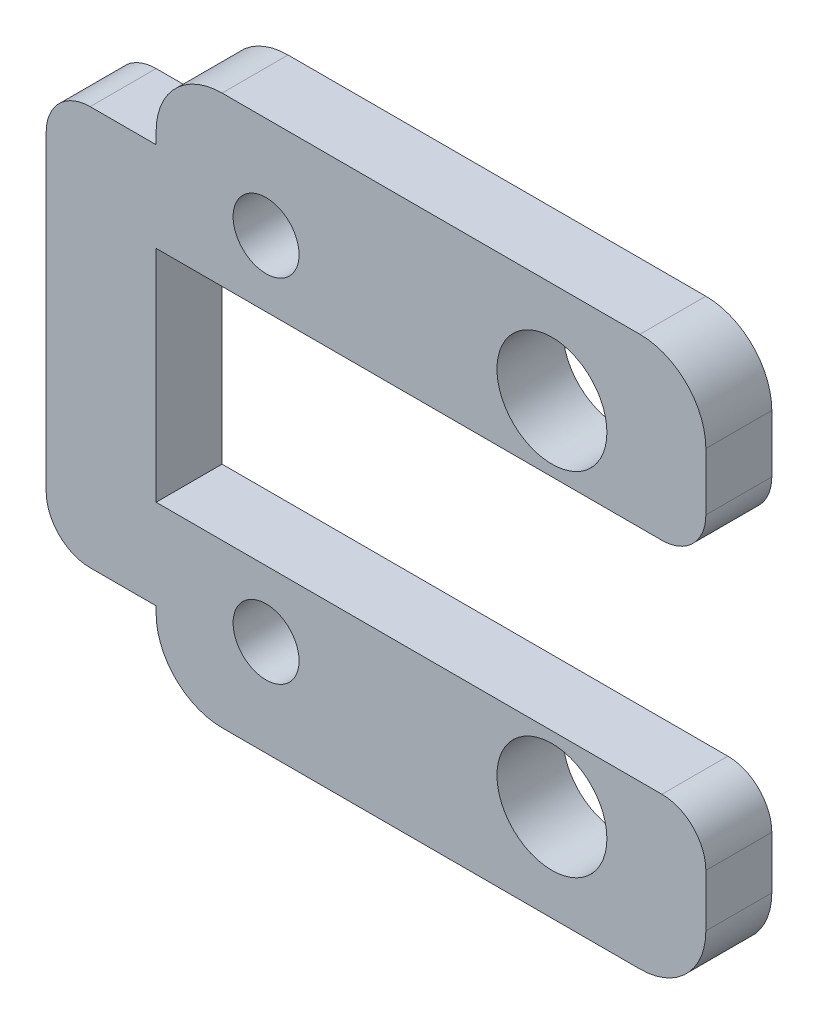
ISO-10303-21;
HEADER;
FILE_DESCRIPTION(('STEP AP214'),'2;1');
FILE_NAME('part.step','',(''),(''),'','','');
FILE_SCHEMA(('AUTOMOTIVE_DESIGN { 1 0 10303 214 1 1 1 1 }'));
ENDSEC;
DATA;
#1=APPLICATION_CONTEXT('core data for automotive mechanical design processes');
#2=APPLICATION_PROTOCOL_DEFINITION('international standard','automotive_design',2000,#1);
#3=PRODUCT_CONTEXT('',#1,'mechanical');
#4=PRODUCT('Part','Part','',(#3));
#5=PRODUCT_RELATED_PRODUCT_CATEGORY('part','',(#4));
#6=PRODUCT_DEFINITION_FORMATION('','',#4);
#7=PRODUCT_DEFINITION_CONTEXT('part definition',#1,'design');
#8=PRODUCT_DEFINITION('design','',#6,#7);
#9=PRODUCT_DEFINITION_SHAPE('','',#8);
#10=(LENGTH_UNIT() NAMED_UNIT(*) SI_UNIT(.MILLI.,.METRE.));
#11=(NAMED_UNIT(*) PLANE_ANGLE_UNIT() SI_UNIT($,.RADIAN.));
#12=(NAMED_UNIT(*) SI_UNIT($,.STERADIAN.) SOLID_ANGLE_UNIT());
#13=UNCERTAINTY_MEASURE_WITH_UNIT(LENGTH_MEASURE(1.E-05),#10,'distance_accuracy_value','');
#14=(GEOMETRIC_REPRESENTATION_CONTEXT(3) GLOBAL_UNCERTAINTY_ASSIGNED_CONTEXT((#13)) GLOBAL_UNIT_ASSIGNED_CONTEXT((#10,
#11,#12)) REPRESENTATION_CONTEXT('',''));
#15=CARTESIAN_POINT('',(0.,0.,0.));
#16=DIRECTION('',(0.,0.,1.));
#17=DIRECTION('',(1.,0.,0.));
#18=AXIS2_PLACEMENT_3D('',#15,#16,#17);
#19=CARTESIAN_POINT('',(-73.8823510218967,-4.69681165989756,3.));
#20=DIRECTION('',(0.,0.,-1.));
#21=DIRECTION('',(-1.,0.,0.));
#22=AXIS2_PLACEMENT_3D('',#19,#20,#21);
#23=PLANE('',#22);
#24=CARTESIAN_POINT('',(-73.8823510218967,-4.69681165989756,3.));
#25=DIRECTION('',(0.,0.,1.));
#26=DIRECTION('',(-1.,0.,0.));
#27=AXIS2_PLACEMENT_3D('',#24,#25,#26);
#28=CIRCLE('',#27,2.);
#29=CARTESIAN_POINT('',(-75.8823510218967,-4.69681165989756,3.));
#30=VERTEX_POINT('',#29);
#31=CARTESIAN_POINT('',(-73.8823510218967,-6.69681165989756,3.));
#32=VERTEX_POINT('',#31);
#33=EDGE_CURVE('E245',#30,#32,#28,.T.);
#34=ORIENTED_EDGE('',*,*,#33,.T.);
#35=DIRECTION('',(1.,0.,0.));
#36=VECTOR('',#35,1.);
#37=CARTESIAN_POINT('',(-70.8823510218967,-6.69681165989756,3.));
#38=LINE('',#37,#36);
#39=CARTESIAN_POINT('',(-70.8823510218967,-6.69681165989756,3.));
#40=VERTEX_POINT('',#39);
#41=EDGE_CURVE('E131',#32,#40,#38,.T.);
#42=ORIENTED_EDGE('',*,*,#41,.T.);
#43=DIRECTION('',(0.,-1.,0.));
#44=VECTOR('',#43,1.);
#45=CARTESIAN_POINT('',(-70.8823510218967,-6.99999999999997,3.));
#46=LINE('',#45,#44);
#47=CARTESIAN_POINT('',(-70.8823510218967,-6.99999999999997,3.));
#48=VERTEX_POINT('',#47);
#49=EDGE_CURVE('E296',#40,#48,#46,.T.);
#50=ORIENTED_EDGE('',*,*,#49,.T.);
#51=CARTESIAN_POINT('',(-67.8823510218967,-6.99999999999999,3.));
#52=DIRECTION('',(0.,0.,1.));
#53=DIRECTION('',(1.,0.,0.));
#54=AXIS2_PLACEMENT_3D('',#51,#52,#53);
#55=CIRCLE('',#54,3.);
#56=CARTESIAN_POINT('',(-67.8823510218966,-10.,3.));
#57=VERTEX_POINT('',#56);
#58=EDGE_CURVE('E315',#48,#57,#55,.T.);
#59=ORIENTED_EDGE('',*,*,#58,.T.);
#60=DIRECTION('',(1.,0.,0.));
#61=VECTOR('',#60,1.);
#62=CARTESIAN_POINT('',(-48.8823510218967,-9.99999999999999,3.));
#63=LINE('',#62,#61);
#64=CARTESIAN_POINT('',(-48.8823510218967,-9.99999999999999,3.));
#65=VERTEX_POINT('',#64);
#66=EDGE_CURVE('E312',#57,#65,#63,.T.);
#67=ORIENTED_EDGE('',*,*,#66,.T.);
#68=CARTESIAN_POINT('',(-48.8823510218967,-6.99999999999999,3.));
#69=DIRECTION('',(0.,0.,1.));
#70=DIRECTION('',(1.,0.,0.));
#71=AXIS2_PLACEMENT_3D('',#68,#69,#70);
#72=CIRCLE('',#71,3.);
#73=CARTESIAN_POINT('',(-45.8823510218967,-6.99999999999997,3.));
#74=VERTEX_POINT('',#73);
#75=EDGE_CURVE('E314',#65,#74,#72,.T.);
#76=ORIENTED_EDGE('',*,*,#75,.T.);
#77=DIRECTION('',(0.,1.,0.));
#78=VECTOR('',#77,1.);
#79=CARTESIAN_POINT('',(-45.8823510218967,-4.61559491585407,3.));
#80=LINE('',#79,#78);
#81=CARTESIAN_POINT('',(-45.8823510218967,-4.61559491585407,3.));
#82=VERTEX_POINT('',#81);
#83=EDGE_CURVE('E317',#74,#82,#80,.T.);
#84=ORIENTED_EDGE('',*,*,#83,.T.);
#85=CARTESIAN_POINT('',(-47.8823510218967,-4.61559491585407,3.));
#86=DIRECTION('',(0.,0.,1.));
#87=DIRECTION('',(1.,0.,0.));
#88=AXIS2_PLACEMENT_3D('',#85,#86,#87);
#89=CIRCLE('',#88,2.);
#90=CARTESIAN_POINT('',(-47.8823510218967,-2.61559491585407,3.));
#91=VERTEX_POINT('',#90);
#92=EDGE_CURVE('E323',#82,#91,#89,.T.);
#93=ORIENTED_EDGE('',*,*,#92,.T.);
#94=DIRECTION('',(-1.,0.,0.));
#95=VECTOR('',#94,1.);
#96=CARTESIAN_POINT('',(-47.8823510218967,-2.61559491585407,3.));
#97=LINE('',#96,#95);
#98=CARTESIAN_POINT('',(-70.8823510218967,-2.61559491585407,3.));
#99=VERTEX_POINT('',#98);
#100=EDGE_CURVE('E325',#91,#99,#97,.T.);
#101=ORIENTED_EDGE('',*,*,#100,.T.);
#102=DIRECTION('',(0.,1.,0.));
#103=VECTOR('',#102,1.);
#104=CARTESIAN_POINT('',(-70.8823510218967,-2.61559491585407,3.));
#105=LINE('',#104,#103);
#106=CARTESIAN_POINT('',(-70.8823510218967,7.38440508414593,3.));
#107=VERTEX_POINT('',#106);
#108=EDGE_CURVE('E327',#99,#107,#105,.T.);
#109=ORIENTED_EDGE('',*,*,#108,.T.);
#110=DIRECTION('',(1.,0.,0.));
#111=VECTOR('',#110,1.);
#112=CARTESIAN_POINT('',(-70.8823510218967,7.38440508414593,3.));
#113=LINE('',#112,#111);
#114=CARTESIAN_POINT('',(-47.8823510218967,7.38440508414593,3.));
#115=VERTEX_POINT('',#114);
#116=EDGE_CURVE('E329',#107,#115,#113,.T.);
#117=ORIENTED_EDGE('',*,*,#116,.T.);
#118=CARTESIAN_POINT('',(-47.8823510218967,9.38440508414593,3.));
#119=DIRECTION('',(0.,0.,1.));
#120=DIRECTION('',(-1.,0.,0.));
#121=AXIS2_PLACEMENT_3D('',#118,#119,#120);
#122=CIRCLE('',#121,2.);
#123=CARTESIAN_POINT('',(-45.8823510218967,9.38440508414593,3.));
#124=VERTEX_POINT('',#123);
#125=EDGE_CURVE('E331',#115,#124,#122,.T.);
#126=ORIENTED_EDGE('',*,*,#125,.T.);
#127=DIRECTION('',(0.,1.,0.));
#128=VECTOR('',#127,1.);
#129=CARTESIAN_POINT('',(-45.8823510218967,12.,3.));
#130=LINE('',#129,#128);
#131=CARTESIAN_POINT('',(-45.8823510218967,12.,3.));
#132=VERTEX_POINT('',#131);
#133=EDGE_CURVE('E333',#124,#132,#130,.T.);
#134=ORIENTED_EDGE('',*,*,#133,.T.);
#135=CARTESIAN_POINT('',(-48.8823510218967,12.,3.));
#136=DIRECTION('',(0.,0.,1.));
#137=DIRECTION('',(1.,0.,0.));
#138=AXIS2_PLACEMENT_3D('',#135,#136,#137);
#139=CIRCLE('',#138,3.);
#140=CARTESIAN_POINT('',(-48.8823510218967,15.,3.));
#141=VERTEX_POINT('',#140);
#142=EDGE_CURVE('E335',#132,#141,#139,.T.);
#143=ORIENTED_EDGE('',*,*,#142,.T.);
#144=DIRECTION('',(-1.,0.,0.));
#145=VECTOR('',#144,1.);
#146=CARTESIAN_POINT('',(-67.8823510218966,15.,3.));
#147=LINE('',#146,#145);
#148=CARTESIAN_POINT('',(-67.8823510218966,15.,3.));
#149=VERTEX_POINT('',#148);
#150=EDGE_CURVE('E337',#141,#149,#147,.T.);
#151=ORIENTED_EDGE('',*,*,#150,.T.);
#152=CARTESIAN_POINT('',(-67.8823510218967,12.,3.));
#153=DIRECTION('',(0.,0.,1.));
#154=DIRECTION('',(-1.,0.,0.));
#155=AXIS2_PLACEMENT_3D('',#152,#153,#154);
#156=CIRCLE('',#155,3.);
#157=CARTESIAN_POINT('',(-70.8823510218967,12.,3.));
#158=VERTEX_POINT('',#157);
#159=EDGE_CURVE('E339',#149,#158,#156,.T.);
#160=ORIENTED_EDGE('',*,*,#159,.T.);
#161=DIRECTION('',(0.,-1.,0.));
#162=VECTOR('',#161,1.);
#163=CARTESIAN_POINT('',(-70.8823510218967,11.4656218281894,3.));
#164=LINE('',#163,#162);
#165=CARTESIAN_POINT('',(-70.8823510218967,11.4656218281894,3.));
#166=VERTEX_POINT('',#165);
#167=EDGE_CURVE('E186',#158,#166,#164,.T.);
#168=ORIENTED_EDGE('',*,*,#167,.T.);
#169=DIRECTION('',(-1.,0.,0.));
#170=VECTOR('',#169,1.);
#171=CARTESIAN_POINT('',(-73.8823510218967,11.4656218281894,3.));
#172=LINE('',#171,#170);
#173=CARTESIAN_POINT('',(-73.8823510218967,11.4656218281894,3.));
#174=VERTEX_POINT('',#173);
#175=EDGE_CURVE('E180',#166,#174,#172,.T.);
#176=ORIENTED_EDGE('',*,*,#175,.T.);
#177=CARTESIAN_POINT('',(-73.8823510218967,9.46562182818942,3.));
#178=DIRECTION('',(0.,0.,1.));
#179=DIRECTION('',(-1.,0.,0.));
#180=AXIS2_PLACEMENT_3D('',#177,#178,#179);
#181=CIRCLE('',#180,2.);
#182=CARTESIAN_POINT('',(-75.8823510218967,9.46562182818942,3.));
#183=VERTEX_POINT('',#182);
#184=EDGE_CURVE('E184',#174,#183,#181,.T.);
#185=ORIENTED_EDGE('',*,*,#184,.T.);
#186=DIRECTION('',(0.,-1.,0.));
#187=VECTOR('',#186,1.);
#188=CARTESIAN_POINT('',(-75.8823510218967,-4.69681165989756,3.));
#189=LINE('',#188,#187);
#190=EDGE_CURVE('E52',#183,#30,#189,.T.);
#191=ORIENTED_EDGE('',*,*,#190,.T.);
#192=EDGE_LOOP('',(#34,#42,#50,#59,#67,#76,#84,#93,#101,#109,#117,#126,#134,#143,#151,#160,#168,
#176,#185,#191));
#193=FACE_BOUND('',#192,.T.);
#194=CARTESIAN_POINT('',(-52.8823510218967,10.3844050841459,3.));
#195=DIRECTION('',(0.,0.,1.));
#196=DIRECTION('',(1.,0.,0.));
#197=AXIS2_PLACEMENT_3D('',#194,#195,#196);
#198=CIRCLE('',#197,2.5);
#199=CARTESIAN_POINT('',(-50.3823510218967,10.3844050841459,3.));
#200=VERTEX_POINT('',#199);
#201=EDGE_CURVE('E208',#200,#200,#198,.T.);
#202=ORIENTED_EDGE('',*,*,#201,.F.);
#203=EDGE_LOOP('',(#202));
#204=FACE_BOUND('',#203,.T.);
#205=CARTESIAN_POINT('',(-52.8823510218967,-5.61559491585407,3.));
#206=DIRECTION('',(0.,0.,1.));
#207=DIRECTION('',(1.,0.,0.));
#208=AXIS2_PLACEMENT_3D('',#205,#206,#207);
#209=CIRCLE('',#208,2.5);
#210=CARTESIAN_POINT('',(-50.3823510218967,-5.61559491585407,3.));
#211=VERTEX_POINT('',#210);
#212=EDGE_CURVE('E403',#211,#211,#209,.T.);
#213=ORIENTED_EDGE('',*,*,#212,.F.);
#214=EDGE_LOOP('',(#213));
#215=FACE_BOUND('',#214,.T.);
#216=CARTESIAN_POINT('',(-65.8823510218967,10.3844050841459,3.));
#217=DIRECTION('',(0.,0.,1.));
#218=DIRECTION('',(1.,0.,0.));
#219=AXIS2_PLACEMENT_3D('',#216,#217,#218);
#220=CIRCLE('',#219,1.5);
#221=CARTESIAN_POINT('',(-64.3823510218967,10.3844050841459,3.));
#222=VERTEX_POINT('',#221);
#223=EDGE_CURVE('E397',#222,#222,#220,.T.);
#224=ORIENTED_EDGE('',*,*,#223,.F.);
#225=EDGE_LOOP('',(#224));
#226=FACE_BOUND('',#225,.T.);
#227=CARTESIAN_POINT('',(-65.8823510218967,-5.61559491585407,3.));
#228=DIRECTION('',(0.,0.,1.));
#229=DIRECTION('',(1.,0.,0.));
#230=AXIS2_PLACEMENT_3D('',#227,#228,#229);
#231=CIRCLE('',#230,1.5);
#232=CARTESIAN_POINT('',(-64.3823510218967,-5.61559491585407,3.));
#233=VERTEX_POINT('',#232);
#234=EDGE_CURVE('E388',#233,#233,#231,.T.);
#235=ORIENTED_EDGE('',*,*,#234,.F.);
#236=EDGE_LOOP('',(#235));
#237=FACE_BOUND('',#236,.T.);
#238=ADVANCED_FACE('F35',(#193,#204,#215,#226,#237),#23,.F.);
#239=CARTESIAN_POINT('',(-73.8823510218967,-4.69681165989756,0.));
#240=DIRECTION('',(0.,0.,-1.));
#241=DIRECTION('',(-1.,0.,0.));
#242=AXIS2_PLACEMENT_3D('',#239,#240,#241);
#243=PLANE('',#242);
#244=CARTESIAN_POINT('',(-65.8823510218967,10.3844050841459,0.));
#245=DIRECTION('',(0.,0.,1.));
#246=DIRECTION('',(1.,0.,0.));
#247=AXIS2_PLACEMENT_3D('',#244,#245,#246);
#248=CIRCLE('',#247,1.5);
#249=CARTESIAN_POINT('',(-64.3823510218967,10.3844050841459,0.));
#250=VERTEX_POINT('',#249);
#251=EDGE_CURVE('E394',#250,#250,#248,.T.);
#252=ORIENTED_EDGE('',*,*,#251,.T.);
#253=EDGE_LOOP('',(#252));
#254=FACE_BOUND('',#253,.T.);
#255=CARTESIAN_POINT('',(-52.8823510218967,10.3844050841459,0.));
#256=DIRECTION('',(0.,0.,1.));
#257=DIRECTION('',(1.,0.,0.));
#258=AXIS2_PLACEMENT_3D('',#255,#256,#257);
#259=CIRCLE('',#258,2.5);
#260=CARTESIAN_POINT('',(-50.3823510218967,10.3844050841459,0.));
#261=VERTEX_POINT('',#260);
#262=EDGE_CURVE('E406',#261,#261,#259,.T.);
#263=ORIENTED_EDGE('',*,*,#262,.T.);
#264=EDGE_LOOP('',(#263));
#265=FACE_BOUND('',#264,.T.);
#266=CARTESIAN_POINT('',(-73.8823510218967,-4.69681165989756,0.));
#267=DIRECTION('',(0.,0.,1.));
#268=DIRECTION('',(-1.,0.,0.));
#269=AXIS2_PLACEMENT_3D('',#266,#267,#268);
#270=CIRCLE('',#269,2.);
#271=CARTESIAN_POINT('',(-75.8823510218967,-4.69681165989756,0.));
#272=VERTEX_POINT('',#271);
#273=CARTESIAN_POINT('',(-73.8823510218967,-6.69681165989756,0.));
#274=VERTEX_POINT('',#273);
#275=EDGE_CURVE('E204',#272,#274,#270,.T.);
#276=ORIENTED_EDGE('',*,*,#275,.F.);
#277=DIRECTION('',(0.,-1.,0.));
#278=VECTOR('',#277,1.);
#279=CARTESIAN_POINT('',(-75.8823510218967,-4.69681165989756,0.));
#280=LINE('',#279,#278);
#281=CARTESIAN_POINT('',(-75.8823510218967,9.46562182818942,0.));
#282=VERTEX_POINT('',#281);
#283=EDGE_CURVE('E123',#282,#272,#280,.T.);
#284=ORIENTED_EDGE('',*,*,#283,.F.);
#285=CARTESIAN_POINT('',(-73.8823510218967,9.46562182818942,0.));
#286=DIRECTION('',(0.,0.,1.));
#287=DIRECTION('',(-1.,0.,0.));
#288=AXIS2_PLACEMENT_3D('',#285,#286,#287);
#289=CIRCLE('',#288,2.);
#290=CARTESIAN_POINT('',(-73.8823510218967,11.4656218281894,0.));
#291=VERTEX_POINT('',#290);
#292=EDGE_CURVE('E117',#291,#282,#289,.T.);
#293=ORIENTED_EDGE('',*,*,#292,.F.);
#294=DIRECTION('',(-1.,0.,0.));
#295=VECTOR('',#294,1.);
#296=CARTESIAN_POINT('',(-73.8823510218967,11.4656218281894,0.));
#297=LINE('',#296,#295);
#298=CARTESIAN_POINT('',(-70.8823510218967,11.4656218281894,0.));
#299=VERTEX_POINT('',#298);
#300=EDGE_CURVE('E194',#299,#291,#297,.T.);
#301=ORIENTED_EDGE('',*,*,#300,.F.);
#302=DIRECTION('',(0.,-1.,0.));
#303=VECTOR('',#302,1.);
#304=CARTESIAN_POINT('',(-70.8823510218967,11.4656218281894,0.));
#305=LINE('',#304,#303);
#306=CARTESIAN_POINT('',(-70.8823510218967,12.,0.));
#307=VERTEX_POINT('',#306);
#308=EDGE_CURVE('E240',#307,#299,#305,.T.);
#309=ORIENTED_EDGE('',*,*,#308,.F.);
#310=CARTESIAN_POINT('',(-67.8823510218967,12.,0.));
#311=DIRECTION('',(0.,0.,1.));
#312=DIRECTION('',(-1.,0.,0.));
#313=AXIS2_PLACEMENT_3D('',#310,#311,#312);
#314=CIRCLE('',#313,3.);
#315=CARTESIAN_POINT('',(-67.8823510218966,15.,0.));
#316=VERTEX_POINT('',#315);
#317=EDGE_CURVE('E238',#316,#307,#314,.T.);
#318=ORIENTED_EDGE('',*,*,#317,.F.);
#319=DIRECTION('',(-1.,0.,0.));
#320=VECTOR('',#319,1.);
#321=CARTESIAN_POINT('',(-67.8823510218966,15.,0.));
#322=LINE('',#321,#320);
#323=CARTESIAN_POINT('',(-48.8823510218967,15.,0.));
#324=VERTEX_POINT('',#323);
#325=EDGE_CURVE('E236',#324,#316,#322,.T.);
#326=ORIENTED_EDGE('',*,*,#325,.F.);
#327=CARTESIAN_POINT('',(-48.8823510218967,12.,0.));
#328=DIRECTION('',(0.,0.,1.));
#329=DIRECTION('',(1.,0.,0.));
#330=AXIS2_PLACEMENT_3D('',#327,#328,#329);
#331=CIRCLE('',#330,3.);
#332=CARTESIAN_POINT('',(-45.8823510218967,12.,0.));
#333=VERTEX_POINT('',#332);
#334=EDGE_CURVE('E234',#333,#324,#331,.T.);
#335=ORIENTED_EDGE('',*,*,#334,.F.);
#336=DIRECTION('',(0.,1.,0.));
#337=VECTOR('',#336,1.);
#338=CARTESIAN_POINT('',(-45.8823510218967,12.,0.));
#339=LINE('',#338,#337);
#340=CARTESIAN_POINT('',(-45.8823510218967,9.38440508414593,0.));
#341=VERTEX_POINT('',#340);
#342=EDGE_CURVE('E232',#341,#333,#339,.T.);
#343=ORIENTED_EDGE('',*,*,#342,.F.);
#344=CARTESIAN_POINT('',(-47.8823510218967,9.38440508414593,0.));
#345=DIRECTION('',(0.,0.,1.));
#346=DIRECTION('',(-1.,0.,0.));
#347=AXIS2_PLACEMENT_3D('',#344,#345,#346);
#348=CIRCLE('',#347,2.);
#349=CARTESIAN_POINT('',(-47.8823510218967,7.38440508414593,0.));
#350=VERTEX_POINT('',#349);
#351=EDGE_CURVE('E230',#350,#341,#348,.T.);
#352=ORIENTED_EDGE('',*,*,#351,.F.);
#353=DIRECTION('',(1.,0.,0.));
#354=VECTOR('',#353,1.);
#355=CARTESIAN_POINT('',(-47.8823510218967,7.38440508414593,0.));
#356=LINE('',#355,#354);
#357=CARTESIAN_POINT('',(-70.8823510218967,7.38440508414593,0.));
#358=VERTEX_POINT('',#357);
#359=EDGE_CURVE('E228',#358,#350,#356,.T.);
#360=ORIENTED_EDGE('',*,*,#359,.F.);
#361=DIRECTION('',(0.,1.,0.));
#362=VECTOR('',#361,1.);
#363=CARTESIAN_POINT('',(-70.8823510218967,-2.61559491585407,0.));
#364=LINE('',#363,#362);
#365=CARTESIAN_POINT('',(-70.8823510218967,-2.61559491585407,0.));
#366=VERTEX_POINT('',#365);
#367=EDGE_CURVE('E225',#366,#358,#364,.T.);
#368=ORIENTED_EDGE('',*,*,#367,.F.);
#369=DIRECTION('',(-1.,0.,0.));
#370=VECTOR('',#369,1.);
#371=CARTESIAN_POINT('',(-55.3823510218967,-2.61559491585407,0.));
#372=LINE('',#371,#370);
#373=CARTESIAN_POINT('',(-47.8823510218967,-2.61559491585407,0.));
#374=VERTEX_POINT('',#373);
#375=EDGE_CURVE('E223',#374,#366,#372,.T.);
#376=ORIENTED_EDGE('',*,*,#375,.F.);
#377=CARTESIAN_POINT('',(-47.8823510218967,-4.61559491585407,0.));
#378=DIRECTION('',(0.,0.,1.));
#379=DIRECTION('',(1.,0.,0.));
#380=AXIS2_PLACEMENT_3D('',#377,#378,#379);
#381=CIRCLE('',#380,2.);
#382=CARTESIAN_POINT('',(-45.8823510218967,-4.61559491585407,0.));
#383=VERTEX_POINT('',#382);
#384=EDGE_CURVE('E220',#383,#374,#381,.T.);
#385=ORIENTED_EDGE('',*,*,#384,.F.);
#386=DIRECTION('',(0.,1.,0.));
#387=VECTOR('',#386,1.);
#388=CARTESIAN_POINT('',(-45.8823510218967,-4.61559491585407,0.));
#389=LINE('',#388,#387);
#390=CARTESIAN_POINT('',(-45.8823510218967,-6.99999999999997,0.));
#391=VERTEX_POINT('',#390);
#392=EDGE_CURVE('E218',#391,#383,#389,.T.);
#393=ORIENTED_EDGE('',*,*,#392,.F.);
#394=CARTESIAN_POINT('',(-48.8823510218967,-6.99999999999999,0.));
#395=DIRECTION('',(0.,0.,1.));
#396=DIRECTION('',(1.,0.,0.));
#397=AXIS2_PLACEMENT_3D('',#394,#395,#396);
#398=CIRCLE('',#397,3.);
#399=CARTESIAN_POINT('',(-48.8823510218967,-9.99999999999999,0.));
#400=VERTEX_POINT('',#399);
#401=EDGE_CURVE('E216',#400,#391,#398,.T.);
#402=ORIENTED_EDGE('',*,*,#401,.F.);
#403=DIRECTION('',(1.,0.,0.));
#404=VECTOR('',#403,1.);
#405=CARTESIAN_POINT('',(-48.8823510218967,-9.99999999999999,0.));
#406=LINE('',#405,#404);
#407=CARTESIAN_POINT('',(-67.8823510218966,-10.,0.));
#408=VERTEX_POINT('',#407);
#409=EDGE_CURVE('E214',#408,#400,#406,.T.);
#410=ORIENTED_EDGE('',*,*,#409,.F.);
#411=CARTESIAN_POINT('',(-67.8823510218967,-6.99999999999999,0.));
#412=DIRECTION('',(0.,0.,1.));
#413=DIRECTION('',(1.,0.,0.));
#414=AXIS2_PLACEMENT_3D('',#411,#412,#413);
#415=CIRCLE('',#414,3.);
#416=CARTESIAN_POINT('',(-70.8823510218967,-6.99999999999997,0.));
#417=VERTEX_POINT('',#416);
#418=EDGE_CURVE('E212',#417,#408,#415,.T.);
#419=ORIENTED_EDGE('',*,*,#418,.F.);
#420=DIRECTION('',(0.,-1.,0.));
#421=VECTOR('',#420,1.);
#422=CARTESIAN_POINT('',(-70.8823510218967,-6.99999999999997,0.));
#423=LINE('',#422,#421);
#424=CARTESIAN_POINT('',(-70.8823510218967,-6.69681165989756,0.));
#425=VERTEX_POINT('',#424);
#426=EDGE_CURVE('E210',#425,#417,#423,.T.);
#427=ORIENTED_EDGE('',*,*,#426,.F.);
#428=DIRECTION('',(1.,0.,0.));
#429=VECTOR('',#428,1.);
#430=CARTESIAN_POINT('',(-70.8823510218967,-6.69681165989756,0.));
#431=LINE('',#430,#429);
#432=EDGE_CURVE('E207',#274,#425,#431,.T.);
#433=ORIENTED_EDGE('',*,*,#432,.F.);
#434=EDGE_LOOP('',(#276,#284,#293,#301,#309,#318,#326,#335,#343,#352,#360,#368,#376,#385,#393,
#402,#410,#419,#427,#433));
#435=FACE_BOUND('',#434,.T.);
#436=CARTESIAN_POINT('',(-52.8823510218967,-5.61559491585407,0.));
#437=DIRECTION('',(0.,0.,1.));
#438=DIRECTION('',(1.,0.,0.));
#439=AXIS2_PLACEMENT_3D('',#436,#437,#438);
#440=CIRCLE('',#439,2.5);
#441=CARTESIAN_POINT('',(-50.3823510218967,-5.61559491585407,0.));
#442=VERTEX_POINT('',#441);
#443=EDGE_CURVE('E400',#442,#442,#440,.T.);
#444=ORIENTED_EDGE('',*,*,#443,.T.);
#445=EDGE_LOOP('',(#444));
#446=FACE_BOUND('',#445,.T.);
#447=CARTESIAN_POINT('',(-65.8823510218967,-5.61559491585407,0.));
#448=DIRECTION('',(0.,0.,1.));
#449=DIRECTION('',(1.,0.,0.));
#450=AXIS2_PLACEMENT_3D('',#447,#448,#449);
#451=CIRCLE('',#450,1.5);
#452=CARTESIAN_POINT('',(-64.3823510218967,-5.61559491585407,0.));
#453=VERTEX_POINT('',#452);
#454=EDGE_CURVE('E391',#453,#453,#451,.T.);
#455=ORIENTED_EDGE('',*,*,#454,.T.);
#456=EDGE_LOOP('',(#455));
#457=FACE_BOUND('',#456,.T.);
#458=ADVANCED_FACE('F300',(#254,#265,#435,#446,#457),#243,.T.);
#459=CARTESIAN_POINT('',(-73.8823510218967,-4.69681165989756,3.));
#460=DIRECTION('',(0.,0.,-1.));
#461=DIRECTION('',(-1.,0.,0.));
#462=AXIS2_PLACEMENT_3D('',#459,#460,#461);
#463=CYLINDRICAL_SURFACE('',#462,2.);
#464=ORIENTED_EDGE('',*,*,#275,.T.);
#465=DIRECTION('',(0.,0.,-1.));
#466=VECTOR('',#465,1.);
#467=CARTESIAN_POINT('',(-73.8823510218967,-6.69681165989756,3.));
#468=LINE('',#467,#466);
#469=EDGE_CURVE('E11',#32,#274,#468,.T.);
#470=ORIENTED_EDGE('',*,*,#469,.F.);
#471=ORIENTED_EDGE('',*,*,#33,.F.);
#472=DIRECTION('',(0.,0.,-1.));
#473=VECTOR('',#472,1.);
#474=CARTESIAN_POINT('',(-75.8823510218967,-4.69681165989756,3.));
#475=LINE('',#474,#473);
#476=EDGE_CURVE('E200',#30,#272,#475,.T.);
#477=ORIENTED_EDGE('',*,*,#476,.T.);
#478=EDGE_LOOP('',(#464,#470,#471,#477));
#479=FACE_BOUND('',#478,.T.);
#480=ADVANCED_FACE('F37',(#479),#463,.T.);
#481=CARTESIAN_POINT('',(-70.8823510218967,-6.69681165989756,3.));
#482=DIRECTION('',(0.,1.,0.));
#483=DIRECTION('',(0.,0.,1.));
#484=AXIS2_PLACEMENT_3D('',#481,#482,#483);
#485=PLANE('',#484);
#486=ORIENTED_EDGE('',*,*,#432,.T.);
#487=DIRECTION('',(0.,0.,-1.));
#488=VECTOR('',#487,1.);
#489=CARTESIAN_POINT('',(-70.8823510218967,-6.69681165989756,3.));
#490=LINE('',#489,#488);
#491=EDGE_CURVE('E44',#40,#425,#490,.T.);
#492=ORIENTED_EDGE('',*,*,#491,.F.);
#493=ORIENTED_EDGE('',*,*,#41,.F.);
#494=ORIENTED_EDGE('',*,*,#469,.T.);
#495=EDGE_LOOP('',(#486,#492,#493,#494));
#496=FACE_BOUND('',#495,.T.);
#497=ADVANCED_FACE('F602',(#496),#485,.F.);
#498=CARTESIAN_POINT('',(-70.8823510218967,-6.99999999999997,3.));
#499=DIRECTION('',(1.,0.,0.));
#500=DIRECTION('',(0.,0.,-1.));
#501=AXIS2_PLACEMENT_3D('',#498,#499,#500);
#502=PLANE('',#501);
#503=ORIENTED_EDGE('',*,*,#426,.T.);
#504=DIRECTION('',(0.,0.,-1.));
#505=VECTOR('',#504,1.);
#506=CARTESIAN_POINT('',(-70.8823510218967,-6.99999999999997,3.));
#507=LINE('',#506,#505);
#508=EDGE_CURVE('E288',#48,#417,#507,.T.);
#509=ORIENTED_EDGE('',*,*,#508,.F.);
#510=ORIENTED_EDGE('',*,*,#49,.F.);
#511=ORIENTED_EDGE('',*,*,#491,.T.);
#512=EDGE_LOOP('',(#503,#509,#510,#511));
#513=FACE_BOUND('',#512,.T.);
#514=ADVANCED_FACE('F294',(#513),#502,.F.);
#515=CARTESIAN_POINT('',(-67.8823510218967,-6.99999999999999,3.));
#516=DIRECTION('',(0.,0.,-1.));
#517=DIRECTION('',(-1.,0.,0.));
#518=AXIS2_PLACEMENT_3D('',#515,#516,#517);
#519=CYLINDRICAL_SURFACE('',#518,3.);
#520=ORIENTED_EDGE('',*,*,#418,.T.);
#521=DIRECTION('',(0.,0.,-1.));
#522=VECTOR('',#521,1.);
#523=CARTESIAN_POINT('',(-67.8823510218966,-10.,3.));
#524=LINE('',#523,#522);
#525=EDGE_CURVE('E285',#57,#408,#524,.T.);
#526=ORIENTED_EDGE('',*,*,#525,.F.);
#527=ORIENTED_EDGE('',*,*,#58,.F.);
#528=ORIENTED_EDGE('',*,*,#508,.T.);
#529=EDGE_LOOP('',(#520,#526,#527,#528));
#530=FACE_BOUND('',#529,.T.);
#531=ADVANCED_FACE('F306',(#530),#519,.T.);
#532=CARTESIAN_POINT('',(-48.8823510218967,-9.99999999999999,3.));
#533=DIRECTION('',(0.,1.,0.));
#534=DIRECTION('',(-1.,0.,0.));
#535=AXIS2_PLACEMENT_3D('',#532,#533,#534);
#536=PLANE('',#535);
#537=ORIENTED_EDGE('',*,*,#409,.T.);
#538=DIRECTION('',(0.,0.,-1.));
#539=VECTOR('',#538,1.);
#540=CARTESIAN_POINT('',(-48.8823510218967,-9.99999999999999,3.));
#541=LINE('',#540,#539);
#542=EDGE_CURVE('E282',#65,#400,#541,.T.);
#543=ORIENTED_EDGE('',*,*,#542,.F.);
#544=ORIENTED_EDGE('',*,*,#66,.F.);
#545=ORIENTED_EDGE('',*,*,#525,.T.);
#546=EDGE_LOOP('',(#537,#543,#544,#545));
#547=FACE_BOUND('',#546,.T.);
#548=ADVANCED_FACE('F310',(#547),#536,.F.);
#549=CARTESIAN_POINT('',(-48.8823510218967,-6.99999999999999,3.));
#550=DIRECTION('',(0.,0.,-1.));
#551=DIRECTION('',(-1.,0.,0.));
#552=AXIS2_PLACEMENT_3D('',#549,#550,#551);
#553=CYLINDRICAL_SURFACE('',#552,3.);
#554=ORIENTED_EDGE('',*,*,#401,.T.);
#555=DIRECTION('',(0.,0.,-1.));
#556=VECTOR('',#555,1.);
#557=CARTESIAN_POINT('',(-45.8823510218967,-6.99999999999997,3.));
#558=LINE('',#557,#556);
#559=EDGE_CURVE('E279',#74,#391,#558,.T.);
#560=ORIENTED_EDGE('',*,*,#559,.F.);
#561=ORIENTED_EDGE('',*,*,#75,.F.);
#562=ORIENTED_EDGE('',*,*,#542,.T.);
#563=EDGE_LOOP('',(#554,#560,#561,#562));
#564=FACE_BOUND('',#563,.T.);
#565=ADVANCED_FACE('F567',(#564),#553,.T.);
#566=CARTESIAN_POINT('',(-45.8823510218967,-4.61559491585407,3.));
#567=DIRECTION('',(-1.,0.,0.));
#568=DIRECTION('',(0.,0.,1.));
#569=AXIS2_PLACEMENT_3D('',#566,#567,#568);
#570=PLANE('',#569);
#571=ORIENTED_EDGE('',*,*,#392,.T.);
#572=DIRECTION('',(0.,0.,-1.));
#573=VECTOR('',#572,1.);
#574=CARTESIAN_POINT('',(-45.8823510218967,-4.61559491585407,3.));
#575=LINE('',#574,#573);
#576=EDGE_CURVE('E276',#82,#383,#575,.T.);
#577=ORIENTED_EDGE('',*,*,#576,.F.);
#578=ORIENTED_EDGE('',*,*,#83,.F.);
#579=ORIENTED_EDGE('',*,*,#559,.T.);
#580=EDGE_LOOP('',(#571,#577,#578,#579));
#581=FACE_BOUND('',#580,.T.);
#582=ADVANCED_FACE('F556',(#581),#570,.F.);
#583=CARTESIAN_POINT('',(-47.8823510218967,-4.61559491585407,3.));
#584=DIRECTION('',(0.,0.,-1.));
#585=DIRECTION('',(-1.,0.,0.));
#586=AXIS2_PLACEMENT_3D('',#583,#584,#585);
#587=CYLINDRICAL_SURFACE('',#586,2.);
#588=ORIENTED_EDGE('',*,*,#384,.T.);
#589=DIRECTION('',(0.,0.,-1.));
#590=VECTOR('',#589,1.);
#591=CARTESIAN_POINT('',(-47.8823510218967,-2.61559491585407,3.));
#592=LINE('',#591,#590);
#593=EDGE_CURVE('E273',#91,#374,#592,.T.);
#594=ORIENTED_EDGE('',*,*,#593,.F.);
#595=ORIENTED_EDGE('',*,*,#92,.F.);
#596=ORIENTED_EDGE('',*,*,#576,.T.);
#597=EDGE_LOOP('',(#588,#594,#595,#596));
#598=FACE_BOUND('',#597,.T.);
#599=ADVANCED_FACE('F545',(#598),#587,.T.);
#600=CARTESIAN_POINT('',(-55.3823510218967,-2.61559491585407,3.));
#601=DIRECTION('',(0.,-1.,0.));
#602=DIRECTION('',(1.,0.,0.));
#603=AXIS2_PLACEMENT_3D('',#600,#601,#602);
#604=PLANE('',#603);
#605=ORIENTED_EDGE('',*,*,#375,.T.);
#606=DIRECTION('',(0.,0.,-1.));
#607=VECTOR('',#606,1.);
#608=CARTESIAN_POINT('',(-70.8823510218967,-2.61559491585407,3.));
#609=LINE('',#608,#607);
#610=EDGE_CURVE('E270',#99,#366,#609,.T.);
#611=ORIENTED_EDGE('',*,*,#610,.F.);
#612=ORIENTED_EDGE('',*,*,#100,.F.);
#613=ORIENTED_EDGE('',*,*,#593,.T.);
#614=EDGE_LOOP('',(#605,#611,#612,#613));
#615=FACE_BOUND('',#614,.T.);
#616=ADVANCED_FACE('F534',(#615),#604,.F.);
#617=CARTESIAN_POINT('',(-70.8823510218967,-2.61559491585407,3.));
#618=DIRECTION('',(-1.,0.,0.));
#619=DIRECTION('',(0.,0.,1.));
#620=AXIS2_PLACEMENT_3D('',#617,#618,#619);
#621=PLANE('',#620);
#622=ORIENTED_EDGE('',*,*,#367,.T.);
#623=DIRECTION('',(0.,0.,-1.));
#624=VECTOR('',#623,1.);
#625=CARTESIAN_POINT('',(-70.8823510218967,7.38440508414593,3.));
#626=LINE('',#625,#624);
#627=EDGE_CURVE('E267',#107,#358,#626,.T.);
#628=ORIENTED_EDGE('',*,*,#627,.F.);
#629=ORIENTED_EDGE('',*,*,#108,.F.);
#630=ORIENTED_EDGE('',*,*,#610,.T.);
#631=EDGE_LOOP('',(#622,#628,#629,#630));
#632=FACE_BOUND('',#631,.T.);
#633=ADVANCED_FACE('F523',(#632),#621,.F.);
#634=CARTESIAN_POINT('',(-47.8823510218967,7.38440508414593,3.));
#635=DIRECTION('',(0.,1.,0.));
#636=DIRECTION('',(-1.,0.,0.));
#637=AXIS2_PLACEMENT_3D('',#634,#635,#636);
#638=PLANE('',#637);
#639=ORIENTED_EDGE('',*,*,#359,.T.);
#640=DIRECTION('',(0.,0.,-1.));
#641=VECTOR('',#640,1.);
#642=CARTESIAN_POINT('',(-47.8823510218967,7.38440508414593,3.));
#643=LINE('',#642,#641);
#644=EDGE_CURVE('E264',#115,#350,#643,.T.);
#645=ORIENTED_EDGE('',*,*,#644,.F.);
#646=ORIENTED_EDGE('',*,*,#116,.F.);
#647=ORIENTED_EDGE('',*,*,#627,.T.);
#648=EDGE_LOOP('',(#639,#645,#646,#647));
#649=FACE_BOUND('',#648,.T.);
#650=ADVANCED_FACE('F513',(#649),#638,.F.);
#651=CARTESIAN_POINT('',(-47.8823510218967,9.38440508414593,3.));
#652=DIRECTION('',(0.,0.,-1.));
#653=DIRECTION('',(-1.,0.,0.));
#654=AXIS2_PLACEMENT_3D('',#651,#652,#653);
#655=CYLINDRICAL_SURFACE('',#654,2.);
#656=ORIENTED_EDGE('',*,*,#351,.T.);
#657=DIRECTION('',(0.,0.,-1.));
#658=VECTOR('',#657,1.);
#659=CARTESIAN_POINT('',(-45.8823510218967,9.38440508414593,3.));
#660=LINE('',#659,#658);
#661=EDGE_CURVE('E261',#124,#341,#660,.T.);
#662=ORIENTED_EDGE('',*,*,#661,.F.);
#663=ORIENTED_EDGE('',*,*,#125,.F.);
#664=ORIENTED_EDGE('',*,*,#644,.T.);
#665=EDGE_LOOP('',(#656,#662,#663,#664));
#666=FACE_BOUND('',#665,.T.);
#667=ADVANCED_FACE('F503',(#666),#655,.T.);
#668=CARTESIAN_POINT('',(-45.8823510218967,12.,3.));
#669=DIRECTION('',(-1.,0.,0.));
#670=DIRECTION('',(0.,0.,1.));
#671=AXIS2_PLACEMENT_3D('',#668,#669,#670);
#672=PLANE('',#671);
#673=ORIENTED_EDGE('',*,*,#342,.T.);
#674=DIRECTION('',(0.,0.,-1.));
#675=VECTOR('',#674,1.);
#676=CARTESIAN_POINT('',(-45.8823510218967,12.,3.));
#677=LINE('',#676,#675);
#678=EDGE_CURVE('E258',#132,#333,#677,.T.);
#679=ORIENTED_EDGE('',*,*,#678,.F.);
#680=ORIENTED_EDGE('',*,*,#133,.F.);
#681=ORIENTED_EDGE('',*,*,#661,.T.);
#682=EDGE_LOOP('',(#673,#679,#680,#681));
#683=FACE_BOUND('',#682,.T.);
#684=ADVANCED_FACE('F493',(#683),#672,.F.);
#685=CARTESIAN_POINT('',(-48.8823510218967,12.,3.));
#686=DIRECTION('',(0.,0.,-1.));
#687=DIRECTION('',(-1.,0.,0.));
#688=AXIS2_PLACEMENT_3D('',#685,#686,#687);
#689=CYLINDRICAL_SURFACE('',#688,3.);
#690=ORIENTED_EDGE('',*,*,#334,.T.);
#691=DIRECTION('',(0.,0.,-1.));
#692=VECTOR('',#691,1.);
#693=CARTESIAN_POINT('',(-48.8823510218967,15.,3.));
#694=LINE('',#693,#692);
#695=EDGE_CURVE('E255',#141,#324,#694,.T.);
#696=ORIENTED_EDGE('',*,*,#695,.F.);
#697=ORIENTED_EDGE('',*,*,#142,.F.);
#698=ORIENTED_EDGE('',*,*,#678,.T.);
#699=EDGE_LOOP('',(#690,#696,#697,#698));
#700=FACE_BOUND('',#699,.T.);
#701=ADVANCED_FACE('F483',(#700),#689,.T.);
#702=CARTESIAN_POINT('',(-67.8823510218966,15.,3.));
#703=DIRECTION('',(0.,-1.,0.));
#704=DIRECTION('',(0.,0.,-1.));
#705=AXIS2_PLACEMENT_3D('',#702,#703,#704);
#706=PLANE('',#705);
#707=ORIENTED_EDGE('',*,*,#325,.T.);
#708=DIRECTION('',(0.,0.,-1.));
#709=VECTOR('',#708,1.);
#710=CARTESIAN_POINT('',(-67.8823510218966,15.,3.));
#711=LINE('',#710,#709);
#712=EDGE_CURVE('E252',#149,#316,#711,.T.);
#713=ORIENTED_EDGE('',*,*,#712,.F.);
#714=ORIENTED_EDGE('',*,*,#150,.F.);
#715=ORIENTED_EDGE('',*,*,#695,.T.);
#716=EDGE_LOOP('',(#707,#713,#714,#715));
#717=FACE_BOUND('',#716,.T.);
#718=ADVANCED_FACE('F474',(#717),#706,.F.);
#719=CARTESIAN_POINT('',(-67.8823510218967,12.,3.));
#720=DIRECTION('',(0.,0.,-1.));
#721=DIRECTION('',(-1.,0.,0.));
#722=AXIS2_PLACEMENT_3D('',#719,#720,#721);
#723=CYLINDRICAL_SURFACE('',#722,3.);
#724=ORIENTED_EDGE('',*,*,#317,.T.);
#725=DIRECTION('',(0.,0.,-1.));
#726=VECTOR('',#725,1.);
#727=CARTESIAN_POINT('',(-70.8823510218967,12.,3.));
#728=LINE('',#727,#726);
#729=EDGE_CURVE('E249',#158,#307,#728,.T.);
#730=ORIENTED_EDGE('',*,*,#729,.F.);
#731=ORIENTED_EDGE('',*,*,#159,.F.);
#732=ORIENTED_EDGE('',*,*,#712,.T.);
#733=EDGE_LOOP('',(#724,#730,#731,#732));
#734=FACE_BOUND('',#733,.T.);
#735=ADVANCED_FACE('F345',(#734),#723,.T.);
#736=CARTESIAN_POINT('',(-70.8823510218967,11.4656218281894,3.));
#737=DIRECTION('',(1.,0.,0.));
#738=DIRECTION('',(0.,0.,-1.));
#739=AXIS2_PLACEMENT_3D('',#736,#737,#738);
#740=PLANE('',#739);
#741=ORIENTED_EDGE('',*,*,#308,.T.);
#742=DIRECTION('',(0.,0.,-1.));
#743=VECTOR('',#742,1.);
#744=CARTESIAN_POINT('',(-70.8823510218967,11.4656218281894,3.));
#745=LINE('',#744,#743);
#746=EDGE_CURVE('E195',#166,#299,#745,.T.);
#747=ORIENTED_EDGE('',*,*,#746,.F.);
#748=ORIENTED_EDGE('',*,*,#167,.F.);
#749=ORIENTED_EDGE('',*,*,#729,.T.);
#750=EDGE_LOOP('',(#741,#747,#748,#749));
#751=FACE_BOUND('',#750,.T.);
#752=ADVANCED_FACE('F349',(#751),#740,.F.);
#753=CARTESIAN_POINT('',(-73.8823510218967,11.4656218281894,3.));
#754=DIRECTION('',(0.,-1.,0.));
#755=DIRECTION('',(0.,0.,-1.));
#756=AXIS2_PLACEMENT_3D('',#753,#754,#755);
#757=PLANE('',#756);
#758=ORIENTED_EDGE('',*,*,#300,.T.);
#759=DIRECTION('',(0.,0.,-1.));
#760=VECTOR('',#759,1.);
#761=CARTESIAN_POINT('',(-73.8823510218967,11.4656218281894,3.));
#762=LINE('',#761,#760);
#763=EDGE_CURVE('E191',#174,#291,#762,.T.);
#764=ORIENTED_EDGE('',*,*,#763,.F.);
#765=ORIENTED_EDGE('',*,*,#175,.F.);
#766=ORIENTED_EDGE('',*,*,#746,.T.);
#767=EDGE_LOOP('',(#758,#764,#765,#766));
#768=FACE_BOUND('',#767,.T.);
#769=ADVANCED_FACE('F192',(#768),#757,.F.);
#770=CARTESIAN_POINT('',(-73.8823510218967,9.46562182818942,3.));
#771=DIRECTION('',(0.,0.,-1.));
#772=DIRECTION('',(-1.,0.,0.));
#773=AXIS2_PLACEMENT_3D('',#770,#771,#772);
#774=CYLINDRICAL_SURFACE('',#773,2.);
#775=ORIENTED_EDGE('',*,*,#292,.T.);
#776=DIRECTION('',(0.,0.,-1.));
#777=VECTOR('',#776,1.);
#778=CARTESIAN_POINT('',(-75.8823510218967,9.46562182818942,3.));
#779=LINE('',#778,#777);
#780=EDGE_CURVE('E196',#183,#282,#779,.T.);
#781=ORIENTED_EDGE('',*,*,#780,.F.);
#782=ORIENTED_EDGE('',*,*,#184,.F.);
#783=ORIENTED_EDGE('',*,*,#763,.T.);
#784=EDGE_LOOP('',(#775,#781,#782,#783));
#785=FACE_BOUND('',#784,.T.);
#786=ADVANCED_FACE('F198',(#785),#774,.T.);
#787=CARTESIAN_POINT('',(-75.8823510218967,-4.69681165989756,3.));
#788=DIRECTION('',(1.,0.,0.));
#789=DIRECTION('',(0.,0.,-1.));
#790=AXIS2_PLACEMENT_3D('',#787,#788,#789);
#791=PLANE('',#790);
#792=ORIENTED_EDGE('',*,*,#283,.T.);
#793=ORIENTED_EDGE('',*,*,#476,.F.);
#794=ORIENTED_EDGE('',*,*,#190,.F.);
#795=ORIENTED_EDGE('',*,*,#780,.T.);
#796=EDGE_LOOP('',(#792,#793,#794,#795));
#797=FACE_BOUND('',#796,.T.);
#798=ADVANCED_FACE('F353',(#797),#791,.F.);
#799=CARTESIAN_POINT('',(-52.8823510218967,10.3844050841459,3.));
#800=DIRECTION('',(0.,0.,-1.));
#801=DIRECTION('',(-1.,0.,0.));
#802=AXIS2_PLACEMENT_3D('',#799,#800,#801);
#803=CYLINDRICAL_SURFACE('',#802,2.5);
#804=ORIENTED_EDGE('',*,*,#201,.T.);
#805=EDGE_LOOP('',(#804));
#806=FACE_BOUND('',#805,.T.);
#807=ORIENTED_EDGE('',*,*,#262,.F.);
#808=EDGE_LOOP('',(#807));
#809=FACE_BOUND('',#808,.T.);
#810=ADVANCED_FACE('F355',(#806,#809),#803,.F.);
#811=CARTESIAN_POINT('',(-52.8823510218967,-5.61559491585407,3.));
#812=DIRECTION('',(0.,0.,-1.));
#813=DIRECTION('',(-1.,0.,0.));
#814=AXIS2_PLACEMENT_3D('',#811,#812,#813);
#815=CYLINDRICAL_SURFACE('',#814,2.5);
#816=ORIENTED_EDGE('',*,*,#212,.T.);
#817=EDGE_LOOP('',(#816));
#818=FACE_BOUND('',#817,.T.);
#819=ORIENTED_EDGE('',*,*,#443,.F.);
#820=EDGE_LOOP('',(#819));
#821=FACE_BOUND('',#820,.T.);
#822=ADVANCED_FACE('F361',(#818,#821),#815,.F.);
#823=CARTESIAN_POINT('',(-65.8823510218967,10.3844050841459,3.));
#824=DIRECTION('',(0.,0.,-1.));
#825=DIRECTION('',(-1.,0.,0.));
#826=AXIS2_PLACEMENT_3D('',#823,#824,#825);
#827=CYLINDRICAL_SURFACE('',#826,1.5);
#828=ORIENTED_EDGE('',*,*,#223,.T.);
#829=EDGE_LOOP('',(#828));
#830=FACE_BOUND('',#829,.T.);
#831=ORIENTED_EDGE('',*,*,#251,.F.);
#832=EDGE_LOOP('',(#831));
#833=FACE_BOUND('',#832,.T.);
#834=ADVANCED_FACE('F375',(#830,#833),#827,.F.);
#835=CARTESIAN_POINT('',(-65.8823510218967,-5.61559491585407,3.));
#836=DIRECTION('',(0.,0.,-1.));
#837=DIRECTION('',(-1.,0.,0.));
#838=AXIS2_PLACEMENT_3D('',#835,#836,#837);
#839=CYLINDRICAL_SURFACE('',#838,1.5);
#840=ORIENTED_EDGE('',*,*,#234,.T.);
#841=EDGE_LOOP('',(#840));
#842=FACE_BOUND('',#841,.T.);
#843=ORIENTED_EDGE('',*,*,#454,.F.);
#844=EDGE_LOOP('',(#843));
#845=FACE_BOUND('',#844,.T.);
#846=ADVANCED_FACE('F379',(#842,#845),#839,.F.);
#847=CLOSED_SHELL('',(#238,#458,#480,#497,#514,#531,#548,#565,#582,#599,#616,#633,#650,#667,
#684,#701,#718,#735,#752,#769,#786,#798,#810,#822,#834,#846));
#848=MANIFOLD_SOLID_BREP('B2',#847);
#849=ADVANCED_BREP_SHAPE_REPRESENTATION('',(#18,#848),#14);
#850=SHAPE_DEFINITION_REPRESENTATION(#9,#849);
ENDSEC;
END-ISO-10303-21;
